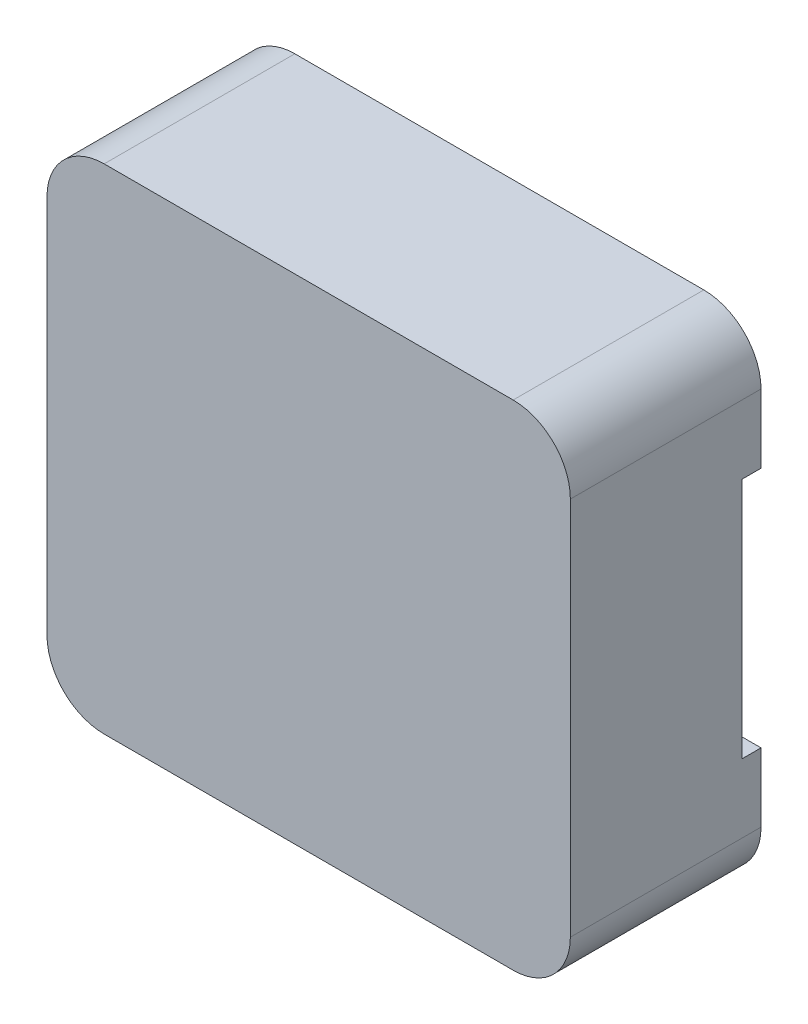
ISO-10303-21;
HEADER;
FILE_DESCRIPTION(('STEP AP214'),'2;1');
FILE_NAME('part.step','',(''),(''),'','','');
FILE_SCHEMA(('AUTOMOTIVE_DESIGN { 1 0 10303 214 1 1 1 1 }'));
ENDSEC;
DATA;
#1=APPLICATION_CONTEXT('core data for automotive mechanical design processes');
#2=APPLICATION_PROTOCOL_DEFINITION('international standard','automotive_design',2000,#1);
#3=PRODUCT_CONTEXT('',#1,'mechanical');
#4=PRODUCT('Part','Part','',(#3));
#5=PRODUCT_RELATED_PRODUCT_CATEGORY('part','',(#4));
#6=PRODUCT_DEFINITION_FORMATION('','',#4);
#7=PRODUCT_DEFINITION_CONTEXT('part definition',#1,'design');
#8=PRODUCT_DEFINITION('design','',#6,#7);
#9=PRODUCT_DEFINITION_SHAPE('','',#8);
#10=(LENGTH_UNIT() NAMED_UNIT(*) SI_UNIT(.MILLI.,.METRE.));
#11=(NAMED_UNIT(*) PLANE_ANGLE_UNIT() SI_UNIT($,.RADIAN.));
#12=(NAMED_UNIT(*) SI_UNIT($,.STERADIAN.) SOLID_ANGLE_UNIT());
#13=UNCERTAINTY_MEASURE_WITH_UNIT(LENGTH_MEASURE(1.E-05),#10,'distance_accuracy_value','');
#14=(GEOMETRIC_REPRESENTATION_CONTEXT(3) GLOBAL_UNCERTAINTY_ASSIGNED_CONTEXT((#13)) GLOBAL_UNIT_ASSIGNED_CONTEXT((#10,
#11,#12)) REPRESENTATION_CONTEXT('',''));
#15=CARTESIAN_POINT('',(0.,0.,0.));
#16=DIRECTION('',(0.,0.,1.));
#17=DIRECTION('',(1.,0.,0.));
#18=AXIS2_PLACEMENT_3D('',#15,#16,#17);
#19=CARTESIAN_POINT('',(0.,0.,2.));
#20=DIRECTION('',(1.,0.,0.));
#21=DIRECTION('',(0.,0.,-1.));
#22=AXIS2_PLACEMENT_3D('',#19,#20,#21);
#23=PLANE('',#22);
#24=DIRECTION('',(0.,1.,0.));
#25=VECTOR('',#24,1.);
#26=CARTESIAN_POINT('',(0.,3.86,0.2));
#27=LINE('',#26,#25);
#28=CARTESIAN_POINT('',(0.,1.32,0.2));
#29=VERTEX_POINT('',#28);
#30=CARTESIAN_POINT('',(0.,3.86,0.2));
#31=VERTEX_POINT('',#30);
#32=EDGE_CURVE('E172',#29,#31,#27,.T.);
#33=ORIENTED_EDGE('',*,*,#32,.F.);
#34=DIRECTION('',(0.,0.,-1.));
#35=VECTOR('',#34,1.);
#36=CARTESIAN_POINT('',(0.,1.32,0.2));
#37=LINE('',#36,#35);
#38=CARTESIAN_POINT('',(0.,1.32,0.));
#39=VERTEX_POINT('',#38);
#40=EDGE_CURVE('E192',#29,#39,#37,.T.);
#41=ORIENTED_EDGE('',*,*,#40,.T.);
#42=DIRECTION('',(0.,-1.,0.));
#43=VECTOR('',#42,1.);
#44=CARTESIAN_POINT('',(0.,0.,0.));
#45=LINE('',#44,#43);
#46=CARTESIAN_POINT('',(0.,0.6,0.));
#47=VERTEX_POINT('',#46);
#48=EDGE_CURVE('E195',#39,#47,#45,.T.);
#49=ORIENTED_EDGE('',*,*,#48,.T.);
#50=DIRECTION('',(0.,0.,-1.));
#51=VECTOR('',#50,1.);
#52=CARTESIAN_POINT('',(0.,0.6,2.));
#53=LINE('',#52,#51);
#54=CARTESIAN_POINT('',(0.,0.6,2.));
#55=VERTEX_POINT('',#54);
#56=EDGE_CURVE('E242',#47,#55,#53,.F.);
#57=ORIENTED_EDGE('',*,*,#56,.T.);
#58=DIRECTION('',(0.,-1.,0.));
#59=VECTOR('',#58,1.);
#60=CARTESIAN_POINT('',(0.,0.,2.));
#61=LINE('',#60,#59);
#62=CARTESIAN_POINT('',(0.,4.58,2.));
#63=VERTEX_POINT('',#62);
#64=EDGE_CURVE('E201',#63,#55,#61,.T.);
#65=ORIENTED_EDGE('',*,*,#64,.F.);
#66=DIRECTION('',(0.,0.,-1.));
#67=VECTOR('',#66,1.);
#68=CARTESIAN_POINT('',(0.,4.58,2.));
#69=LINE('',#68,#67);
#70=CARTESIAN_POINT('',(0.,4.58,0.));
#71=VERTEX_POINT('',#70);
#72=EDGE_CURVE('E239',#63,#71,#69,.T.);
#73=ORIENTED_EDGE('',*,*,#72,.T.);
#74=CARTESIAN_POINT('',(0.,3.86,0.));
#75=VERTEX_POINT('',#74);
#76=EDGE_CURVE('E215',#71,#75,#45,.T.);
#77=ORIENTED_EDGE('',*,*,#76,.T.);
#78=DIRECTION('',(0.,0.,-1.));
#79=VECTOR('',#78,1.);
#80=CARTESIAN_POINT('',(0.,3.86,0.2));
#81=LINE('',#80,#79);
#82=EDGE_CURVE('E53',#31,#75,#81,.T.);
#83=ORIENTED_EDGE('',*,*,#82,.F.);
#84=EDGE_LOOP('',(#33,#41,#49,#57,#65,#73,#77,#83));
#85=FACE_BOUND('',#84,.T.);
#86=ADVANCED_FACE('F30',(#85),#23,.F.);
#87=CARTESIAN_POINT('',(0.,0.,2.));
#88=DIRECTION('',(0.,1.,0.));
#89=DIRECTION('',(0.,0.,1.));
#90=AXIS2_PLACEMENT_3D('',#87,#88,#89);
#91=PLANE('',#90);
#92=DIRECTION('',(1.,0.,0.));
#93=VECTOR('',#92,1.);
#94=CARTESIAN_POINT('',(0.,0.,2.));
#95=LINE('',#94,#93);
#96=CARTESIAN_POINT('',(0.6,0.,2.));
#97=VERTEX_POINT('',#96);
#98=CARTESIAN_POINT('',(4.89,0.,2.));
#99=VERTEX_POINT('',#98);
#100=EDGE_CURVE('E204',#97,#99,#95,.T.);
#101=ORIENTED_EDGE('',*,*,#100,.F.);
#102=DIRECTION('',(0.,0.,-1.));
#103=VECTOR('',#102,1.);
#104=CARTESIAN_POINT('',(0.6,0.,2.));
#105=LINE('',#104,#103);
#106=CARTESIAN_POINT('',(0.6,0.,0.));
#107=VERTEX_POINT('',#106);
#108=EDGE_CURVE('E226',#97,#107,#105,.T.);
#109=ORIENTED_EDGE('',*,*,#108,.T.);
#110=DIRECTION('',(1.,0.,0.));
#111=VECTOR('',#110,1.);
#112=CARTESIAN_POINT('',(0.,0.,0.));
#113=LINE('',#112,#111);
#114=CARTESIAN_POINT('',(4.89,0.,0.));
#115=VERTEX_POINT('',#114);
#116=EDGE_CURVE('E218',#107,#115,#113,.T.);
#117=ORIENTED_EDGE('',*,*,#116,.T.);
#118=DIRECTION('',(0.,0.,-1.));
#119=VECTOR('',#118,1.);
#120=CARTESIAN_POINT('',(4.89,0.,2.));
#121=LINE('',#120,#119);
#122=EDGE_CURVE('E214',#115,#99,#121,.F.);
#123=ORIENTED_EDGE('',*,*,#122,.T.);
#124=EDGE_LOOP('',(#101,#109,#117,#123));
#125=FACE_BOUND('',#124,.T.);
#126=ADVANCED_FACE('F290',(#125),#91,.F.);
#127=CARTESIAN_POINT('',(5.49,0.,2.));
#128=DIRECTION('',(-1.,0.,0.));
#129=DIRECTION('',(0.,0.,1.));
#130=AXIS2_PLACEMENT_3D('',#127,#128,#129);
#131=PLANE('',#130);
#132=DIRECTION('',(0.,-1.,0.));
#133=VECTOR('',#132,1.);
#134=CARTESIAN_POINT('',(5.49,3.86,0.2));
#135=LINE('',#134,#133);
#136=CARTESIAN_POINT('',(5.49,3.86,0.2));
#137=VERTEX_POINT('',#136);
#138=CARTESIAN_POINT('',(5.49,1.32,0.2));
#139=VERTEX_POINT('',#138);
#140=EDGE_CURVE('E151',#137,#139,#135,.T.);
#141=ORIENTED_EDGE('',*,*,#140,.F.);
#142=DIRECTION('',(0.,0.,-1.));
#143=VECTOR('',#142,1.);
#144=CARTESIAN_POINT('',(5.49,3.86,0.2));
#145=LINE('',#144,#143);
#146=CARTESIAN_POINT('',(5.49,3.86,0.));
#147=VERTEX_POINT('',#146);
#148=EDGE_CURVE('E188',#137,#147,#145,.T.);
#149=ORIENTED_EDGE('',*,*,#148,.T.);
#150=DIRECTION('',(0.,1.,0.));
#151=VECTOR('',#150,1.);
#152=CARTESIAN_POINT('',(5.49,0.,0.));
#153=LINE('',#152,#151);
#154=CARTESIAN_POINT('',(5.49,4.58,0.));
#155=VERTEX_POINT('',#154);
#156=EDGE_CURVE('E221',#147,#155,#153,.T.);
#157=ORIENTED_EDGE('',*,*,#156,.T.);
#158=DIRECTION('',(0.,0.,-1.));
#159=VECTOR('',#158,1.);
#160=CARTESIAN_POINT('',(5.49,4.58,2.));
#161=LINE('',#160,#159);
#162=CARTESIAN_POINT('',(5.49,4.58,2.));
#163=VERTEX_POINT('',#162);
#164=EDGE_CURVE('E38',#155,#163,#161,.F.);
#165=ORIENTED_EDGE('',*,*,#164,.T.);
#166=DIRECTION('',(0.,1.,0.));
#167=VECTOR('',#166,1.);
#168=CARTESIAN_POINT('',(5.49,0.,2.));
#169=LINE('',#168,#167);
#170=CARTESIAN_POINT('',(5.49,0.6,2.));
#171=VERTEX_POINT('',#170);
#172=EDGE_CURVE('E208',#171,#163,#169,.T.);
#173=ORIENTED_EDGE('',*,*,#172,.F.);
#174=DIRECTION('',(0.,0.,-1.));
#175=VECTOR('',#174,1.);
#176=CARTESIAN_POINT('',(5.49,0.6,2.));
#177=LINE('',#176,#175);
#178=CARTESIAN_POINT('',(5.49,0.6,0.));
#179=VERTEX_POINT('',#178);
#180=EDGE_CURVE('E11',#171,#179,#177,.T.);
#181=ORIENTED_EDGE('',*,*,#180,.T.);
#182=CARTESIAN_POINT('',(5.49,1.32,0.));
#183=VERTEX_POINT('',#182);
#184=EDGE_CURVE('E165',#179,#183,#153,.T.);
#185=ORIENTED_EDGE('',*,*,#184,.T.);
#186=DIRECTION('',(0.,0.,-1.));
#187=VECTOR('',#186,1.);
#188=CARTESIAN_POINT('',(5.49,1.32,0.2));
#189=LINE('',#188,#187);
#190=EDGE_CURVE('E45',#139,#183,#189,.T.);
#191=ORIENTED_EDGE('',*,*,#190,.F.);
#192=EDGE_LOOP('',(#141,#149,#157,#165,#173,#181,#185,#191));
#193=FACE_BOUND('',#192,.T.);
#194=ADVANCED_FACE('F163',(#193),#131,.F.);
#195=CARTESIAN_POINT('',(0.,5.18,2.));
#196=DIRECTION('',(0.,-1.,0.));
#197=DIRECTION('',(0.,0.,-1.));
#198=AXIS2_PLACEMENT_3D('',#195,#196,#197);
#199=PLANE('',#198);
#200=DIRECTION('',(-1.,0.,0.));
#201=VECTOR('',#200,1.);
#202=CARTESIAN_POINT('',(0.,5.18,0.));
#203=LINE('',#202,#201);
#204=CARTESIAN_POINT('',(4.89,5.18,0.));
#205=VERTEX_POINT('',#204);
#206=CARTESIAN_POINT('',(0.6,5.18,0.));
#207=VERTEX_POINT('',#206);
#208=EDGE_CURVE('E205',#205,#207,#203,.T.);
#209=ORIENTED_EDGE('',*,*,#208,.T.);
#210=DIRECTION('',(0.,0.,-1.));
#211=VECTOR('',#210,1.);
#212=CARTESIAN_POINT('',(0.6,5.18,2.));
#213=LINE('',#212,#211);
#214=CARTESIAN_POINT('',(0.6,5.18,2.));
#215=VERTEX_POINT('',#214);
#216=EDGE_CURVE('E255',#207,#215,#213,.F.);
#217=ORIENTED_EDGE('',*,*,#216,.T.);
#218=DIRECTION('',(-1.,0.,0.));
#219=VECTOR('',#218,1.);
#220=CARTESIAN_POINT('',(0.,5.18,2.));
#221=LINE('',#220,#219);
#222=CARTESIAN_POINT('',(4.89,5.18,2.));
#223=VERTEX_POINT('',#222);
#224=EDGE_CURVE('E211',#223,#215,#221,.T.);
#225=ORIENTED_EDGE('',*,*,#224,.F.);
#226=DIRECTION('',(0.,0.,-1.));
#227=VECTOR('',#226,1.);
#228=CARTESIAN_POINT('',(4.89,5.18,2.));
#229=LINE('',#228,#227);
#230=EDGE_CURVE('E252',#223,#205,#229,.T.);
#231=ORIENTED_EDGE('',*,*,#230,.T.);
#232=EDGE_LOOP('',(#209,#217,#225,#231));
#233=FACE_BOUND('',#232,.T.);
#234=ADVANCED_FACE('F269',(#233),#199,.F.);
#235=CARTESIAN_POINT('',(0.,5.18,2.));
#236=DIRECTION('',(0.,0.,-1.));
#237=DIRECTION('',(-1.,0.,0.));
#238=AXIS2_PLACEMENT_3D('',#235,#236,#237);
#239=PLANE('',#238);
#240=ORIENTED_EDGE('',*,*,#64,.T.);
#241=CARTESIAN_POINT('',(0.6,0.6,2.));
#242=DIRECTION('',(0.,0.,-1.));
#243=DIRECTION('',(-1.,0.,0.));
#244=AXIS2_PLACEMENT_3D('',#241,#242,#243);
#245=CIRCLE('',#244,0.6);
#246=EDGE_CURVE('E250',#55,#97,#245,.F.);
#247=ORIENTED_EDGE('',*,*,#246,.T.);
#248=ORIENTED_EDGE('',*,*,#100,.T.);
#249=CARTESIAN_POINT('',(4.89,0.6,2.));
#250=DIRECTION('',(0.,0.,-1.));
#251=DIRECTION('',(-1.,0.,0.));
#252=AXIS2_PLACEMENT_3D('',#249,#250,#251);
#253=CIRCLE('',#252,0.6);
#254=EDGE_CURVE('E246',#99,#171,#253,.F.);
#255=ORIENTED_EDGE('',*,*,#254,.T.);
#256=ORIENTED_EDGE('',*,*,#172,.T.);
#257=CARTESIAN_POINT('',(4.89,4.58,2.));
#258=DIRECTION('',(0.,0.,-1.));
#259=DIRECTION('',(-1.,0.,0.));
#260=AXIS2_PLACEMENT_3D('',#257,#258,#259);
#261=CIRCLE('',#260,0.6);
#262=EDGE_CURVE('E244',#163,#223,#261,.F.);
#263=ORIENTED_EDGE('',*,*,#262,.T.);
#264=ORIENTED_EDGE('',*,*,#224,.T.);
#265=CARTESIAN_POINT('',(0.6,4.58,2.));
#266=DIRECTION('',(0.,0.,-1.));
#267=DIRECTION('',(-1.,0.,0.));
#268=AXIS2_PLACEMENT_3D('',#265,#266,#267);
#269=CIRCLE('',#268,0.6);
#270=EDGE_CURVE('E248',#215,#63,#269,.F.);
#271=ORIENTED_EDGE('',*,*,#270,.T.);
#272=EDGE_LOOP('',(#240,#247,#248,#255,#256,#263,#264,#271));
#273=FACE_BOUND('',#272,.T.);
#274=ADVANCED_FACE('F263',(#273),#239,.F.);
#275=CARTESIAN_POINT('',(0.,5.18,0.));
#276=DIRECTION('',(0.,0.,-1.));
#277=DIRECTION('',(-1.,0.,0.));
#278=AXIS2_PLACEMENT_3D('',#275,#276,#277);
#279=PLANE('',#278);
#280=DIRECTION('',(1.,0.,0.));
#281=VECTOR('',#280,1.);
#282=CARTESIAN_POINT('',(4.47,3.86,0.));
#283=LINE('',#282,#281);
#284=CARTESIAN_POINT('',(4.47,3.86,0.));
#285=VERTEX_POINT('',#284);
#286=EDGE_CURVE('E160',#285,#147,#283,.T.);
#287=ORIENTED_EDGE('',*,*,#286,.F.);
#288=DIRECTION('',(0.,1.,0.));
#289=VECTOR('',#288,1.);
#290=CARTESIAN_POINT('',(4.47,1.32,0.));
#291=LINE('',#290,#289);
#292=CARTESIAN_POINT('',(4.47,1.32,0.));
#293=VERTEX_POINT('',#292);
#294=EDGE_CURVE('E447',#293,#285,#291,.T.);
#295=ORIENTED_EDGE('',*,*,#294,.F.);
#296=DIRECTION('',(-1.,0.,0.));
#297=VECTOR('',#296,1.);
#298=CARTESIAN_POINT('',(4.47,1.32,0.));
#299=LINE('',#298,#297);
#300=EDGE_CURVE('E448',#183,#293,#299,.T.);
#301=ORIENTED_EDGE('',*,*,#300,.F.);
#302=ORIENTED_EDGE('',*,*,#184,.F.);
#303=CARTESIAN_POINT('',(4.89,0.6,0.));
#304=DIRECTION('',(0.,0.,-1.));
#305=DIRECTION('',(-1.,0.,0.));
#306=AXIS2_PLACEMENT_3D('',#303,#304,#305);
#307=CIRCLE('',#306,0.6);
#308=EDGE_CURVE('E232',#179,#115,#307,.T.);
#309=ORIENTED_EDGE('',*,*,#308,.T.);
#310=ORIENTED_EDGE('',*,*,#116,.F.);
#311=CARTESIAN_POINT('',(0.6,0.6,0.));
#312=DIRECTION('',(0.,0.,-1.));
#313=DIRECTION('',(-1.,0.,0.));
#314=AXIS2_PLACEMENT_3D('',#311,#312,#313);
#315=CIRCLE('',#314,0.6);
#316=EDGE_CURVE('E236',#107,#47,#315,.T.);
#317=ORIENTED_EDGE('',*,*,#316,.T.);
#318=ORIENTED_EDGE('',*,*,#48,.F.);
#319=DIRECTION('',(-1.,0.,0.));
#320=VECTOR('',#319,1.);
#321=CARTESIAN_POINT('',(0.,1.32,0.));
#322=LINE('',#321,#320);
#323=CARTESIAN_POINT('',(1.02,1.32,0.));
#324=VERTEX_POINT('',#323);
#325=EDGE_CURVE('E176',#324,#39,#322,.T.);
#326=ORIENTED_EDGE('',*,*,#325,.F.);
#327=DIRECTION('',(0.,-1.,0.));
#328=VECTOR('',#327,1.);
#329=CARTESIAN_POINT('',(1.02,3.86,0.));
#330=LINE('',#329,#328);
#331=CARTESIAN_POINT('',(1.02,3.86,0.));
#332=VERTEX_POINT('',#331);
#333=EDGE_CURVE('E187',#332,#324,#330,.T.);
#334=ORIENTED_EDGE('',*,*,#333,.F.);
#335=DIRECTION('',(1.,0.,0.));
#336=VECTOR('',#335,1.);
#337=CARTESIAN_POINT('',(0.,3.86,0.));
#338=LINE('',#337,#336);
#339=EDGE_CURVE('E185',#75,#332,#338,.T.);
#340=ORIENTED_EDGE('',*,*,#339,.F.);
#341=ORIENTED_EDGE('',*,*,#76,.F.);
#342=CARTESIAN_POINT('',(0.6,4.58,0.));
#343=DIRECTION('',(0.,0.,-1.));
#344=DIRECTION('',(-1.,0.,0.));
#345=AXIS2_PLACEMENT_3D('',#342,#343,#344);
#346=CIRCLE('',#345,0.6);
#347=EDGE_CURVE('E234',#71,#207,#346,.T.);
#348=ORIENTED_EDGE('',*,*,#347,.T.);
#349=ORIENTED_EDGE('',*,*,#208,.F.);
#350=CARTESIAN_POINT('',(4.89,4.58,0.));
#351=DIRECTION('',(0.,0.,-1.));
#352=DIRECTION('',(-1.,0.,0.));
#353=AXIS2_PLACEMENT_3D('',#350,#351,#352);
#354=CIRCLE('',#353,0.6);
#355=EDGE_CURVE('E229',#205,#155,#354,.T.);
#356=ORIENTED_EDGE('',*,*,#355,.T.);
#357=ORIENTED_EDGE('',*,*,#156,.F.);
#358=EDGE_LOOP('',(#287,#295,#301,#302,#309,#310,#317,#318,#326,#334,#340,#341,#348,#349,#356,#357));
#359=FACE_BOUND('',#358,.T.);
#360=ADVANCED_FACE('F273',(#359),#279,.T.);
#361=CARTESIAN_POINT('',(0.6,0.6,2.));
#362=DIRECTION('',(0.,0.,-1.));
#363=DIRECTION('',(-1.,0.,0.));
#364=AXIS2_PLACEMENT_3D('',#361,#362,#363);
#365=CYLINDRICAL_SURFACE('',#364,0.6);
#366=ORIENTED_EDGE('',*,*,#246,.F.);
#367=ORIENTED_EDGE('',*,*,#56,.F.);
#368=ORIENTED_EDGE('',*,*,#316,.F.);
#369=ORIENTED_EDGE('',*,*,#108,.F.);
#370=EDGE_LOOP('',(#366,#367,#368,#369));
#371=FACE_BOUND('',#370,.T.);
#372=ADVANCED_FACE('F287',(#371),#365,.T.);
#373=CARTESIAN_POINT('',(0.6,4.58,2.));
#374=DIRECTION('',(0.,0.,-1.));
#375=DIRECTION('',(-1.,0.,0.));
#376=AXIS2_PLACEMENT_3D('',#373,#374,#375);
#377=CYLINDRICAL_SURFACE('',#376,0.6);
#378=ORIENTED_EDGE('',*,*,#270,.F.);
#379=ORIENTED_EDGE('',*,*,#216,.F.);
#380=ORIENTED_EDGE('',*,*,#347,.F.);
#381=ORIENTED_EDGE('',*,*,#72,.F.);
#382=EDGE_LOOP('',(#378,#379,#380,#381));
#383=FACE_BOUND('',#382,.T.);
#384=ADVANCED_FACE('F278',(#383),#377,.T.);
#385=CARTESIAN_POINT('',(4.89,0.6,2.));
#386=DIRECTION('',(0.,0.,-1.));
#387=DIRECTION('',(-1.,0.,0.));
#388=AXIS2_PLACEMENT_3D('',#385,#386,#387);
#389=CYLINDRICAL_SURFACE('',#388,0.6);
#390=ORIENTED_EDGE('',*,*,#254,.F.);
#391=ORIENTED_EDGE('',*,*,#122,.F.);
#392=ORIENTED_EDGE('',*,*,#308,.F.);
#393=ORIENTED_EDGE('',*,*,#180,.F.);
#394=EDGE_LOOP('',(#390,#391,#392,#393));
#395=FACE_BOUND('',#394,.T.);
#396=ADVANCED_FACE('F294',(#395),#389,.T.);
#397=CARTESIAN_POINT('',(4.89,4.58,2.));
#398=DIRECTION('',(0.,0.,-1.));
#399=DIRECTION('',(-1.,0.,0.));
#400=AXIS2_PLACEMENT_3D('',#397,#398,#399);
#401=CYLINDRICAL_SURFACE('',#400,0.6);
#402=ORIENTED_EDGE('',*,*,#262,.F.);
#403=ORIENTED_EDGE('',*,*,#164,.F.);
#404=ORIENTED_EDGE('',*,*,#355,.F.);
#405=ORIENTED_EDGE('',*,*,#230,.F.);
#406=EDGE_LOOP('',(#402,#403,#404,#405));
#407=FACE_BOUND('',#406,.T.);
#408=ADVANCED_FACE('F32',(#407),#401,.T.);
#409=CARTESIAN_POINT('',(0.,1.32,0.2));
#410=DIRECTION('',(0.,-1.,0.));
#411=DIRECTION('',(1.,0.,0.));
#412=AXIS2_PLACEMENT_3D('',#409,#410,#411);
#413=PLANE('',#412);
#414=ORIENTED_EDGE('',*,*,#325,.T.);
#415=ORIENTED_EDGE('',*,*,#40,.F.);
#416=DIRECTION('',(-1.,0.,0.));
#417=VECTOR('',#416,1.);
#418=CARTESIAN_POINT('',(0.,1.32,0.2));
#419=LINE('',#418,#417);
#420=CARTESIAN_POINT('',(1.02,1.32,0.2));
#421=VERTEX_POINT('',#420);
#422=EDGE_CURVE('E182',#421,#29,#419,.T.);
#423=ORIENTED_EDGE('',*,*,#422,.F.);
#424=DIRECTION('',(0.,0.,-1.));
#425=VECTOR('',#424,1.);
#426=CARTESIAN_POINT('',(1.02,1.32,0.2));
#427=LINE('',#426,#425);
#428=EDGE_CURVE('E196',#421,#324,#427,.T.);
#429=ORIENTED_EDGE('',*,*,#428,.T.);
#430=EDGE_LOOP('',(#414,#415,#423,#429));
#431=FACE_BOUND('',#430,.T.);
#432=ADVANCED_FACE('F300',(#431),#413,.F.);
#433=CARTESIAN_POINT('',(1.02,3.86,0.2));
#434=DIRECTION('',(1.,0.,0.));
#435=DIRECTION('',(0.,0.,-1.));
#436=AXIS2_PLACEMENT_3D('',#433,#434,#435);
#437=PLANE('',#436);
#438=ORIENTED_EDGE('',*,*,#333,.T.);
#439=ORIENTED_EDGE('',*,*,#428,.F.);
#440=DIRECTION('',(0.,-1.,0.));
#441=VECTOR('',#440,1.);
#442=CARTESIAN_POINT('',(1.02,3.86,0.2));
#443=LINE('',#442,#441);
#444=CARTESIAN_POINT('',(1.02,3.86,0.2));
#445=VERTEX_POINT('',#444);
#446=EDGE_CURVE('E179',#445,#421,#443,.T.);
#447=ORIENTED_EDGE('',*,*,#446,.F.);
#448=DIRECTION('',(0.,0.,-1.));
#449=VECTOR('',#448,1.);
#450=CARTESIAN_POINT('',(1.02,3.86,0.2));
#451=LINE('',#450,#449);
#452=EDGE_CURVE('E198',#445,#332,#451,.T.);
#453=ORIENTED_EDGE('',*,*,#452,.T.);
#454=EDGE_LOOP('',(#438,#439,#447,#453));
#455=FACE_BOUND('',#454,.T.);
#456=ADVANCED_FACE('F377',(#455),#437,.F.);
#457=CARTESIAN_POINT('',(0.,3.86,0.2));
#458=DIRECTION('',(0.,1.,0.));
#459=DIRECTION('',(0.,0.,1.));
#460=AXIS2_PLACEMENT_3D('',#457,#458,#459);
#461=PLANE('',#460);
#462=ORIENTED_EDGE('',*,*,#339,.T.);
#463=ORIENTED_EDGE('',*,*,#452,.F.);
#464=DIRECTION('',(1.,0.,0.));
#465=VECTOR('',#464,1.);
#466=CARTESIAN_POINT('',(0.,3.86,0.2));
#467=LINE('',#466,#465);
#468=EDGE_CURVE('E175',#31,#445,#467,.T.);
#469=ORIENTED_EDGE('',*,*,#468,.F.);
#470=ORIENTED_EDGE('',*,*,#82,.T.);
#471=EDGE_LOOP('',(#462,#463,#469,#470));
#472=FACE_BOUND('',#471,.T.);
#473=ADVANCED_FACE('F384',(#472),#461,.F.);
#474=CARTESIAN_POINT('',(0.,1.32,0.2));
#475=DIRECTION('',(0.,0.,1.));
#476=DIRECTION('',(1.,0.,0.));
#477=AXIS2_PLACEMENT_3D('',#474,#475,#476);
#478=PLANE('',#477);
#479=ORIENTED_EDGE('',*,*,#32,.T.);
#480=ORIENTED_EDGE('',*,*,#468,.T.);
#481=ORIENTED_EDGE('',*,*,#446,.T.);
#482=ORIENTED_EDGE('',*,*,#422,.T.);
#483=EDGE_LOOP('',(#479,#480,#481,#482));
#484=FACE_BOUND('',#483,.T.);
#485=ADVANCED_FACE('F392',(#484),#478,.F.);
#486=CARTESIAN_POINT('',(4.47,3.86,0.2));
#487=DIRECTION('',(0.,1.,0.));
#488=DIRECTION('',(0.,0.,1.));
#489=AXIS2_PLACEMENT_3D('',#486,#487,#488);
#490=PLANE('',#489);
#491=ORIENTED_EDGE('',*,*,#286,.T.);
#492=ORIENTED_EDGE('',*,*,#148,.F.);
#493=DIRECTION('',(1.,0.,0.));
#494=VECTOR('',#493,1.);
#495=CARTESIAN_POINT('',(4.47,3.86,0.2));
#496=LINE('',#495,#494);
#497=CARTESIAN_POINT('',(4.47,3.86,0.2));
#498=VERTEX_POINT('',#497);
#499=EDGE_CURVE('E157',#498,#137,#496,.T.);
#500=ORIENTED_EDGE('',*,*,#499,.F.);
#501=DIRECTION('',(0.,0.,-1.));
#502=VECTOR('',#501,1.);
#503=CARTESIAN_POINT('',(4.47,3.86,0.2));
#504=LINE('',#503,#502);
#505=EDGE_CURVE('E167',#498,#285,#504,.T.);
#506=ORIENTED_EDGE('',*,*,#505,.T.);
#507=EDGE_LOOP('',(#491,#492,#500,#506));
#508=FACE_BOUND('',#507,.T.);
#509=ADVANCED_FACE('F398',(#508),#490,.F.);
#510=CARTESIAN_POINT('',(4.47,1.32,0.2));
#511=DIRECTION('',(-1.,0.,0.));
#512=DIRECTION('',(0.,0.,1.));
#513=AXIS2_PLACEMENT_3D('',#510,#511,#512);
#514=PLANE('',#513);
#515=ORIENTED_EDGE('',*,*,#294,.T.);
#516=ORIENTED_EDGE('',*,*,#505,.F.);
#517=DIRECTION('',(0.,1.,0.));
#518=VECTOR('',#517,1.);
#519=CARTESIAN_POINT('',(4.47,1.32,0.2));
#520=LINE('',#519,#518);
#521=CARTESIAN_POINT('',(4.47,1.32,0.2));
#522=VERTEX_POINT('',#521);
#523=EDGE_CURVE('E150',#522,#498,#520,.T.);
#524=ORIENTED_EDGE('',*,*,#523,.F.);
#525=DIRECTION('',(0.,0.,-1.));
#526=VECTOR('',#525,1.);
#527=CARTESIAN_POINT('',(4.47,1.32,0.2));
#528=LINE('',#527,#526);
#529=EDGE_CURVE('E146',#522,#293,#528,.T.);
#530=ORIENTED_EDGE('',*,*,#529,.T.);
#531=EDGE_LOOP('',(#515,#516,#524,#530));
#532=FACE_BOUND('',#531,.T.);
#533=ADVANCED_FACE('F406',(#532),#514,.F.);
#534=CARTESIAN_POINT('',(4.47,1.32,0.2));
#535=DIRECTION('',(0.,-1.,0.));
#536=DIRECTION('',(0.,0.,-1.));
#537=AXIS2_PLACEMENT_3D('',#534,#535,#536);
#538=PLANE('',#537);
#539=ORIENTED_EDGE('',*,*,#300,.T.);
#540=ORIENTED_EDGE('',*,*,#529,.F.);
#541=DIRECTION('',(-1.,0.,0.));
#542=VECTOR('',#541,1.);
#543=CARTESIAN_POINT('',(4.47,1.32,0.2));
#544=LINE('',#543,#542);
#545=EDGE_CURVE('E143',#139,#522,#544,.T.);
#546=ORIENTED_EDGE('',*,*,#545,.F.);
#547=ORIENTED_EDGE('',*,*,#190,.T.);
#548=EDGE_LOOP('',(#539,#540,#546,#547));
#549=FACE_BOUND('',#548,.T.);
#550=ADVANCED_FACE('F145',(#549),#538,.F.);
#551=CARTESIAN_POINT('',(5.49,1.32,0.2));
#552=DIRECTION('',(0.,0.,1.));
#553=DIRECTION('',(1.,0.,0.));
#554=AXIS2_PLACEMENT_3D('',#551,#552,#553);
#555=PLANE('',#554);
#556=ORIENTED_EDGE('',*,*,#140,.T.);
#557=ORIENTED_EDGE('',*,*,#545,.T.);
#558=ORIENTED_EDGE('',*,*,#523,.T.);
#559=ORIENTED_EDGE('',*,*,#499,.T.);
#560=EDGE_LOOP('',(#556,#557,#558,#559));
#561=FACE_BOUND('',#560,.T.);
#562=ADVANCED_FACE('F155',(#561),#555,.F.);
#563=CLOSED_SHELL('',(#86,#126,#194,#234,#274,#360,#372,#384,#396,#408,#432,#456,#473,#485,#509,
#533,#550,#562));
#564=MANIFOLD_SOLID_BREP('B2',#563);
#565=ADVANCED_BREP_SHAPE_REPRESENTATION('',(#18,#564),#14);
#566=SHAPE_DEFINITION_REPRESENTATION(#9,#565);
ENDSEC;
END-ISO-10303-21;
